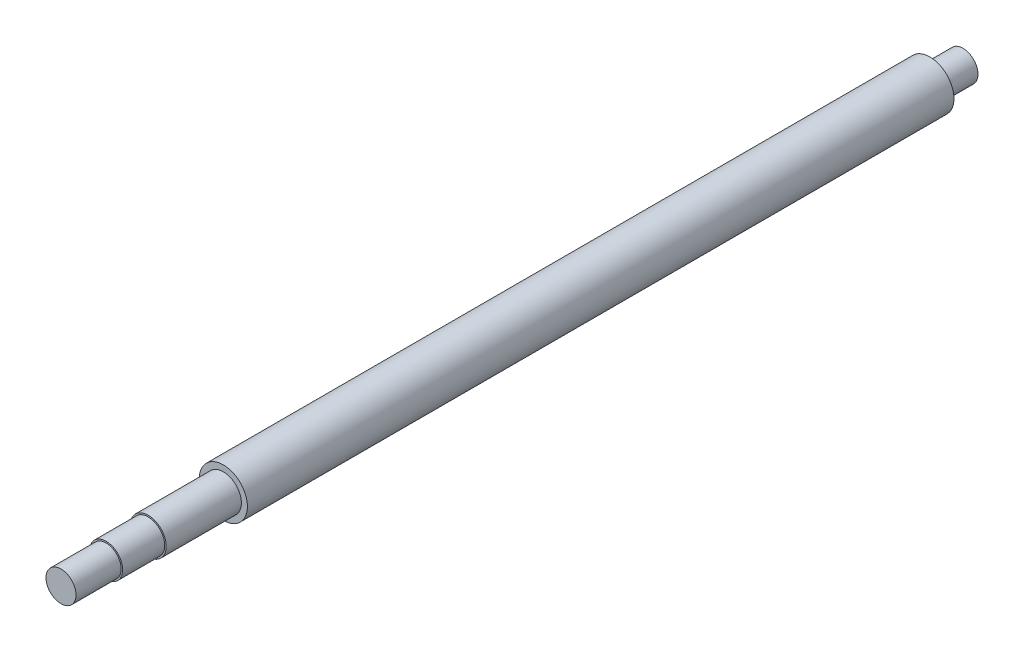
ISO-10303-21;
HEADER;
FILE_DESCRIPTION(('STEP AP214'),'2;1');
FILE_NAME('part.step','',(''),(''),'','','');
FILE_SCHEMA(('AUTOMOTIVE_DESIGN { 1 0 10303 214 1 1 1 1 }'));
ENDSEC;
DATA;
#1=APPLICATION_CONTEXT('core data for automotive mechanical design processes');
#2=APPLICATION_PROTOCOL_DEFINITION('international standard','automotive_design',2000,#1);
#3=PRODUCT_CONTEXT('',#1,'mechanical');
#4=PRODUCT('Part','Part','',(#3));
#5=PRODUCT_RELATED_PRODUCT_CATEGORY('part','',(#4));
#6=PRODUCT_DEFINITION_FORMATION('','',#4);
#7=PRODUCT_DEFINITION_CONTEXT('part definition',#1,'design');
#8=PRODUCT_DEFINITION('design','',#6,#7);
#9=PRODUCT_DEFINITION_SHAPE('','',#8);
#10=(LENGTH_UNIT() NAMED_UNIT(*) SI_UNIT(.MILLI.,.METRE.));
#11=(NAMED_UNIT(*) PLANE_ANGLE_UNIT() SI_UNIT($,.RADIAN.));
#12=(NAMED_UNIT(*) SI_UNIT($,.STERADIAN.) SOLID_ANGLE_UNIT());
#13=UNCERTAINTY_MEASURE_WITH_UNIT(LENGTH_MEASURE(1.E-05),#10,'distance_accuracy_value','');
#14=(GEOMETRIC_REPRESENTATION_CONTEXT(3) GLOBAL_UNCERTAINTY_ASSIGNED_CONTEXT((#13)) GLOBAL_UNIT_ASSIGNED_CONTEXT((#10,
#11,#12)) REPRESENTATION_CONTEXT('',''));
#15=CARTESIAN_POINT('',(0.,0.,0.));
#16=DIRECTION('',(0.,0.,1.));
#17=DIRECTION('',(1.,0.,0.));
#18=AXIS2_PLACEMENT_3D('',#15,#16,#17);
#19=CARTESIAN_POINT('',(0.,69.625,163.95));
#20=DIRECTION('',(0.,0.,1.));
#21=DIRECTION('',(1.,0.,0.));
#22=AXIS2_PLACEMENT_3D('',#19,#20,#21);
#23=PLANE('',#22);
#24=CARTESIAN_POINT('',(0.,69.625,163.95));
#25=DIRECTION('',(0.,0.,1.));
#26=DIRECTION('',(1.,0.,0.));
#27=AXIS2_PLACEMENT_3D('',#24,#25,#26);
#28=CIRCLE('',#27,5.);
#29=CARTESIAN_POINT('',(5.,69.625,163.95));
#30=VERTEX_POINT('',#29);
#31=EDGE_CURVE('E10',#30,#30,#28,.T.);
#32=ORIENTED_EDGE('',*,*,#31,.T.);
#33=EDGE_LOOP('',(#32));
#34=FACE_BOUND('',#33,.T.);
#35=ADVANCED_FACE('F31',(#34),#23,.T.);
#36=CARTESIAN_POINT('',(0.,69.625,163.95));
#37=DIRECTION('',(0.,0.,1.));
#38=DIRECTION('',(1.,0.,0.));
#39=AXIS2_PLACEMENT_3D('',#36,#37,#38);
#40=CYLINDRICAL_SURFACE('',#39,5.);
#41=CARTESIAN_POINT('',(0.,69.625,148.95));
#42=DIRECTION('',(0.,0.,1.));
#43=DIRECTION('',(1.,0.,0.));
#44=AXIS2_PLACEMENT_3D('',#41,#42,#43);
#45=CIRCLE('',#44,5.);
#46=CARTESIAN_POINT('',(5.,69.625,148.95));
#47=VERTEX_POINT('',#46);
#48=EDGE_CURVE('E37',#47,#47,#45,.T.);
#49=ORIENTED_EDGE('',*,*,#48,.T.);
#50=EDGE_LOOP('',(#49));
#51=FACE_BOUND('',#50,.T.);
#52=ORIENTED_EDGE('',*,*,#31,.F.);
#53=EDGE_LOOP('',(#52));
#54=FACE_BOUND('',#53,.T.);
#55=ADVANCED_FACE('F81',(#51,#54),#40,.T.);
#56=CARTESIAN_POINT('',(0.,64.625,148.95));
#57=DIRECTION('',(0.,0.,1.));
#58=DIRECTION('',(1.,0.,0.));
#59=AXIS2_PLACEMENT_3D('',#56,#57,#58);
#60=PLANE('',#59);
#61=CARTESIAN_POINT('',(0.,69.625,148.95));
#62=DIRECTION('',(0.,0.,1.));
#63=DIRECTION('',(1.,0.,0.));
#64=AXIS2_PLACEMENT_3D('',#61,#62,#63);
#65=CIRCLE('',#64,5.50000000000001);
#66=CARTESIAN_POINT('',(5.50000000000001,69.625,148.95));
#67=VERTEX_POINT('',#66);
#68=EDGE_CURVE('E41',#67,#67,#65,.T.);
#69=ORIENTED_EDGE('',*,*,#68,.T.);
#70=EDGE_LOOP('',(#69));
#71=FACE_BOUND('',#70,.T.);
#72=ORIENTED_EDGE('',*,*,#48,.F.);
#73=EDGE_LOOP('',(#72));
#74=FACE_BOUND('',#73,.T.);
#75=ADVANCED_FACE('F85',(#71,#74),#60,.T.);
#76=CARTESIAN_POINT('',(0.,69.625,163.95));
#77=DIRECTION('',(0.,0.,1.));
#78=DIRECTION('',(1.,0.,0.));
#79=AXIS2_PLACEMENT_3D('',#76,#77,#78);
#80=CYLINDRICAL_SURFACE('',#79,5.50000000000001);
#81=CARTESIAN_POINT('',(0.,69.625,134.95));
#82=DIRECTION('',(0.,0.,1.));
#83=DIRECTION('',(1.,0.,0.));
#84=AXIS2_PLACEMENT_3D('',#81,#82,#83);
#85=CIRCLE('',#84,5.50000000000001);
#86=CARTESIAN_POINT('',(5.50000000000001,69.625,134.95));
#87=VERTEX_POINT('',#86);
#88=EDGE_CURVE('E45',#87,#87,#85,.T.);
#89=ORIENTED_EDGE('',*,*,#88,.T.);
#90=EDGE_LOOP('',(#89));
#91=FACE_BOUND('',#90,.T.);
#92=ORIENTED_EDGE('',*,*,#68,.F.);
#93=EDGE_LOOP('',(#92));
#94=FACE_BOUND('',#93,.T.);
#95=ADVANCED_FACE('F89',(#91,#94),#80,.T.);
#96=CARTESIAN_POINT('',(0.,64.125,134.95));
#97=DIRECTION('',(0.,0.,1.));
#98=DIRECTION('',(1.,0.,0.));
#99=AXIS2_PLACEMENT_3D('',#96,#97,#98);
#100=PLANE('',#99);
#101=CARTESIAN_POINT('',(0.,69.625,134.95));
#102=DIRECTION('',(0.,0.,1.));
#103=DIRECTION('',(1.,0.,0.));
#104=AXIS2_PLACEMENT_3D('',#101,#102,#103);
#105=CIRCLE('',#104,6.00000000000001);
#106=CARTESIAN_POINT('',(6.00000000000001,69.625,134.95));
#107=VERTEX_POINT('',#106);
#108=EDGE_CURVE('E50',#107,#107,#105,.T.);
#109=ORIENTED_EDGE('',*,*,#108,.T.);
#110=EDGE_LOOP('',(#109));
#111=FACE_BOUND('',#110,.T.);
#112=ORIENTED_EDGE('',*,*,#88,.F.);
#113=EDGE_LOOP('',(#112));
#114=FACE_BOUND('',#113,.T.);
#115=ADVANCED_FACE('F96',(#111,#114),#100,.T.);
#116=CARTESIAN_POINT('',(0.,69.625,163.95));
#117=DIRECTION('',(0.,0.,1.));
#118=DIRECTION('',(1.,0.,0.));
#119=AXIS2_PLACEMENT_3D('',#116,#117,#118);
#120=CYLINDRICAL_SURFACE('',#119,6.00000000000001);
#121=CARTESIAN_POINT('',(0.,69.625,109.95));
#122=DIRECTION('',(0.,0.,1.));
#123=DIRECTION('',(1.,0.,0.));
#124=AXIS2_PLACEMENT_3D('',#121,#122,#123);
#125=CIRCLE('',#124,6.00000000000001);
#126=CARTESIAN_POINT('',(6.00000000000001,69.625,109.95));
#127=VERTEX_POINT('',#126);
#128=EDGE_CURVE('E53',#127,#127,#125,.T.);
#129=ORIENTED_EDGE('',*,*,#128,.T.);
#130=EDGE_LOOP('',(#129));
#131=FACE_BOUND('',#130,.T.);
#132=ORIENTED_EDGE('',*,*,#108,.F.);
#133=EDGE_LOOP('',(#132));
#134=FACE_BOUND('',#133,.T.);
#135=ADVANCED_FACE('F100',(#131,#134),#120,.T.);
#136=CARTESIAN_POINT('',(0.,63.625,109.95));
#137=DIRECTION('',(0.,0.,1.));
#138=DIRECTION('',(1.,0.,0.));
#139=AXIS2_PLACEMENT_3D('',#136,#137,#138);
#140=PLANE('',#139);
#141=CARTESIAN_POINT('',(0.,69.625,109.95));
#142=DIRECTION('',(0.,0.,1.));
#143=DIRECTION('',(1.,0.,0.));
#144=AXIS2_PLACEMENT_3D('',#141,#142,#143);
#145=CIRCLE('',#144,8.);
#146=CARTESIAN_POINT('',(8.,69.625,109.95));
#147=VERTEX_POINT('',#146);
#148=EDGE_CURVE('E56',#147,#147,#145,.T.);
#149=ORIENTED_EDGE('',*,*,#148,.T.);
#150=EDGE_LOOP('',(#149));
#151=FACE_BOUND('',#150,.T.);
#152=ORIENTED_EDGE('',*,*,#128,.F.);
#153=EDGE_LOOP('',(#152));
#154=FACE_BOUND('',#153,.T.);
#155=ADVANCED_FACE('F104',(#151,#154),#140,.T.);
#156=CARTESIAN_POINT('',(0.,69.625,163.95));
#157=DIRECTION('',(0.,0.,1.));
#158=DIRECTION('',(1.,0.,0.));
#159=AXIS2_PLACEMENT_3D('',#156,#157,#158);
#160=CYLINDRICAL_SURFACE('',#159,8.);
#161=CARTESIAN_POINT('',(0.,69.625,-125.05));
#162=DIRECTION('',(0.,0.,1.));
#163=DIRECTION('',(1.,0.,0.));
#164=AXIS2_PLACEMENT_3D('',#161,#162,#163);
#165=CIRCLE('',#164,8.);
#166=CARTESIAN_POINT('',(8.,69.625,-125.05));
#167=VERTEX_POINT('',#166);
#168=EDGE_CURVE('E59',#167,#167,#165,.T.);
#169=ORIENTED_EDGE('',*,*,#168,.T.);
#170=EDGE_LOOP('',(#169));
#171=FACE_BOUND('',#170,.T.);
#172=ORIENTED_EDGE('',*,*,#148,.F.);
#173=EDGE_LOOP('',(#172));
#174=FACE_BOUND('',#173,.T.);
#175=ADVANCED_FACE('F108',(#171,#174),#160,.T.);
#176=CARTESIAN_POINT('',(0.,61.625,-125.05));
#177=DIRECTION('',(0.,0.,-1.));
#178=DIRECTION('',(-1.,0.,0.));
#179=AXIS2_PLACEMENT_3D('',#176,#177,#178);
#180=PLANE('',#179);
#181=CARTESIAN_POINT('',(0.,69.625,-125.05));
#182=DIRECTION('',(0.,0.,1.));
#183=DIRECTION('',(1.,0.,0.));
#184=AXIS2_PLACEMENT_3D('',#181,#182,#183);
#185=CIRCLE('',#184,5.);
#186=CARTESIAN_POINT('',(5.,69.625,-125.05));
#187=VERTEX_POINT('',#186);
#188=EDGE_CURVE('E62',#187,#187,#185,.T.);
#189=ORIENTED_EDGE('',*,*,#188,.T.);
#190=EDGE_LOOP('',(#189));
#191=FACE_BOUND('',#190,.T.);
#192=ORIENTED_EDGE('',*,*,#168,.F.);
#193=EDGE_LOOP('',(#192));
#194=FACE_BOUND('',#193,.T.);
#195=ADVANCED_FACE('F78',(#191,#194),#180,.T.);
#196=CARTESIAN_POINT('',(0.,69.625,163.95));
#197=DIRECTION('',(0.,0.,1.));
#198=DIRECTION('',(1.,0.,0.));
#199=AXIS2_PLACEMENT_3D('',#196,#197,#198);
#200=CYLINDRICAL_SURFACE('',#199,5.);
#201=CARTESIAN_POINT('',(0.,69.625,-136.05));
#202=DIRECTION('',(0.,0.,1.));
#203=DIRECTION('',(1.,0.,0.));
#204=AXIS2_PLACEMENT_3D('',#201,#202,#203);
#205=CIRCLE('',#204,5.);
#206=CARTESIAN_POINT('',(5.,69.625,-136.05));
#207=VERTEX_POINT('',#206);
#208=EDGE_CURVE('E65',#207,#207,#205,.T.);
#209=ORIENTED_EDGE('',*,*,#208,.T.);
#210=EDGE_LOOP('',(#209));
#211=FACE_BOUND('',#210,.T.);
#212=ORIENTED_EDGE('',*,*,#188,.F.);
#213=EDGE_LOOP('',(#212));
#214=FACE_BOUND('',#213,.T.);
#215=ADVANCED_FACE('F69',(#211,#214),#200,.T.);
#216=CARTESIAN_POINT('',(0.,64.625,-136.05));
#217=DIRECTION('',(0.,0.,-1.));
#218=DIRECTION('',(-1.,0.,0.));
#219=AXIS2_PLACEMENT_3D('',#216,#217,#218);
#220=PLANE('',#219);
#221=ORIENTED_EDGE('',*,*,#208,.F.);
#222=EDGE_LOOP('',(#221));
#223=FACE_BOUND('',#222,.T.);
#224=ADVANCED_FACE('F72',(#223),#220,.T.);
#225=CLOSED_SHELL('',(#35,#55,#75,#95,#115,#135,#155,#175,#195,#215,#224));
#226=MANIFOLD_SOLID_BREP('B2',#225);
#227=ADVANCED_BREP_SHAPE_REPRESENTATION('',(#18,#226),#14);
#228=SHAPE_DEFINITION_REPRESENTATION(#9,#227);
ENDSEC;
END-ISO-10303-21;
